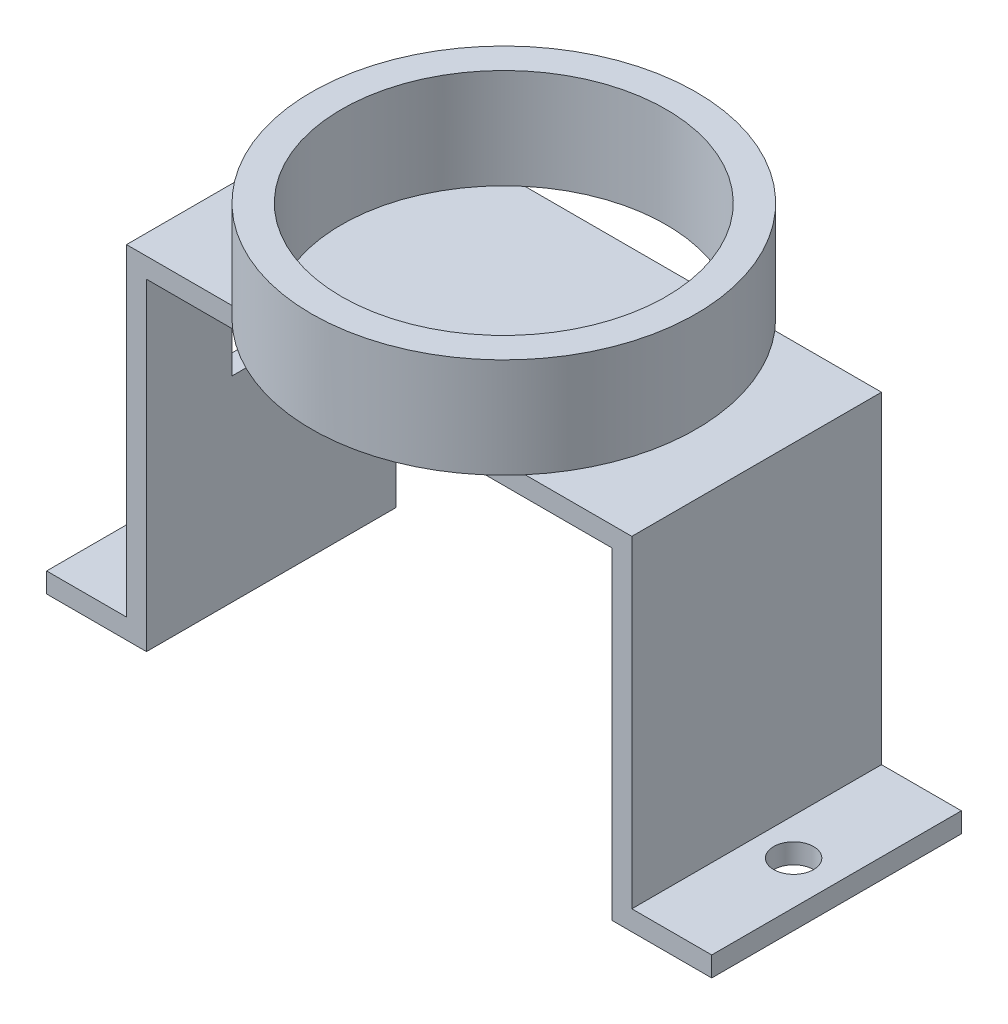
ISO-10303-21;
HEADER;
FILE_DESCRIPTION(('STEP AP214'),'2;1');
FILE_NAME('part.step','',(''),(''),'','','');
FILE_SCHEMA(('AUTOMOTIVE_DESIGN { 1 0 10303 214 1 1 1 1 }'));
ENDSEC;
DATA;
#1=APPLICATION_CONTEXT('core data for automotive mechanical design processes');
#2=APPLICATION_PROTOCOL_DEFINITION('international standard','automotive_design',2000,#1);
#3=PRODUCT_CONTEXT('',#1,'mechanical');
#4=PRODUCT('Part','Part','',(#3));
#5=PRODUCT_RELATED_PRODUCT_CATEGORY('part','',(#4));
#6=PRODUCT_DEFINITION_FORMATION('','',#4);
#7=PRODUCT_DEFINITION_CONTEXT('part definition',#1,'design');
#8=PRODUCT_DEFINITION('design','',#6,#7);
#9=PRODUCT_DEFINITION_SHAPE('','',#8);
#10=(LENGTH_UNIT() NAMED_UNIT(*) SI_UNIT(.MILLI.,.METRE.));
#11=(NAMED_UNIT(*) PLANE_ANGLE_UNIT() SI_UNIT($,.RADIAN.));
#12=(NAMED_UNIT(*) SI_UNIT($,.STERADIAN.) SOLID_ANGLE_UNIT());
#13=UNCERTAINTY_MEASURE_WITH_UNIT(LENGTH_MEASURE(1.E-05),#10,'distance_accuracy_value','');
#14=(GEOMETRIC_REPRESENTATION_CONTEXT(3) GLOBAL_UNCERTAINTY_ASSIGNED_CONTEXT((#13)) GLOBAL_UNIT_ASSIGNED_CONTEXT((#10,
#11,#12)) REPRESENTATION_CONTEXT('',''));
#15=CARTESIAN_POINT('',(0.,0.,0.));
#16=DIRECTION('',(0.,0.,1.));
#17=DIRECTION('',(1.,0.,0.));
#18=AXIS2_PLACEMENT_3D('',#15,#16,#17);
#19=CARTESIAN_POINT('',(0.,17.15,12.5));
#20=DIRECTION('',(0.,1.,0.));
#21=DIRECTION('',(0.,0.,1.));
#22=AXIS2_PLACEMENT_3D('',#19,#20,#21);
#23=PLANE('',#22);
#24=DIRECTION('',(1.,0.,0.));
#25=VECTOR('',#24,1.);
#26=CARTESIAN_POINT('',(0.,17.15,12.5));
#27=LINE('',#26,#25);
#28=CARTESIAN_POINT('',(6.4483600856761,17.15,12.5));
#29=VERTEX_POINT('',#28);
#30=CARTESIAN_POINT('',(16.8316399143243,17.15,12.5));
#31=VERTEX_POINT('',#30);
#32=EDGE_CURVE('E179',#29,#31,#27,.T.);
#33=ORIENTED_EDGE('',*,*,#32,.T.);
#34=CARTESIAN_POINT('',(11.6400000000002,17.15,6.25000000000026));
#35=DIRECTION('',(0.,1.,0.));
#36=DIRECTION('',(0.,0.,1.));
#37=AXIS2_PLACEMENT_3D('',#34,#35,#36);
#38=CIRCLE('',#37,8.125);
#39=CARTESIAN_POINT('',(16.8316399143237,17.15,0.));
#40=VERTEX_POINT('',#39);
#41=EDGE_CURVE('E218',#31,#40,#38,.T.);
#42=ORIENTED_EDGE('',*,*,#41,.T.);
#43=DIRECTION('',(1.,0.,0.));
#44=VECTOR('',#43,1.);
#45=CARTESIAN_POINT('',(0.,17.15,0.));
#46=LINE('',#45,#44);
#47=CARTESIAN_POINT('',(6.44836008567671,17.15,0.));
#48=VERTEX_POINT('',#47);
#49=EDGE_CURVE('E266',#48,#40,#46,.T.);
#50=ORIENTED_EDGE('',*,*,#49,.F.);
#51=EDGE_CURVE('E41',#48,#29,#38,.T.);
#52=ORIENTED_EDGE('',*,*,#51,.T.);
#53=EDGE_LOOP('',(#33,#42,#50,#52));
#54=FACE_BOUND('',#53,.T.);
#55=ADVANCED_FACE('F32',(#54),#23,.T.);
#56=CARTESIAN_POINT('',(11.6400000000002,17.15,6.25000000000026));
#57=DIRECTION('',(0.,1.,0.));
#58=DIRECTION('',(0.,0.,1.));
#59=AXIS2_PLACEMENT_3D('',#56,#57,#58);
#60=CIRCLE('',#59,9.625);
#61=CARTESIAN_POINT('',(18.9597079859791,17.15,12.5));
#62=VERTEX_POINT('',#61);
#63=CARTESIAN_POINT('',(18.9597079859787,17.15,0.));
#64=VERTEX_POINT('',#63);
#65=EDGE_CURVE('E43',#62,#64,#60,.T.);
#66=ORIENTED_EDGE('',*,*,#65,.F.);
#67=CARTESIAN_POINT('',(24.3,17.15,12.5));
#68=VERTEX_POINT('',#67);
#69=EDGE_CURVE('E180',#62,#68,#27,.T.);
#70=ORIENTED_EDGE('',*,*,#69,.T.);
#71=DIRECTION('',(0.,0.,-1.));
#72=VECTOR('',#71,1.);
#73=CARTESIAN_POINT('',(24.3,17.15,12.5));
#74=LINE('',#73,#72);
#75=CARTESIAN_POINT('',(24.3,17.15,0.));
#76=VERTEX_POINT('',#75);
#77=EDGE_CURVE('E236',#68,#76,#74,.T.);
#78=ORIENTED_EDGE('',*,*,#77,.T.);
#79=EDGE_CURVE('E195',#64,#76,#46,.T.);
#80=ORIENTED_EDGE('',*,*,#79,.F.);
#81=EDGE_LOOP('',(#66,#70,#78,#80));
#82=FACE_BOUND('',#81,.T.);
#83=ADVANCED_FACE('F192',(#82),#23,.T.);
#84=CARTESIAN_POINT('',(23.3,0.,12.5));
#85=DIRECTION('',(0.,1.,0.));
#86=DIRECTION('',(0.,0.,1.));
#87=AXIS2_PLACEMENT_3D('',#84,#85,#86);
#88=PLANE('',#87);
#89=CARTESIAN_POINT('',(26.15,0.,6.25));
#90=DIRECTION('',(0.,1.,0.));
#91=DIRECTION('',(-1.,0.,0.));
#92=AXIS2_PLACEMENT_3D('',#89,#90,#91);
#93=CIRCLE('',#92,1.00000000000007);
#94=CARTESIAN_POINT('',(25.1499999999999,0.,6.25));
#95=VERTEX_POINT('',#94);
#96=EDGE_CURVE('E405',#95,#95,#93,.T.);
#97=ORIENTED_EDGE('',*,*,#96,.T.);
#98=EDGE_LOOP('',(#97));
#99=FACE_BOUND('',#98,.T.);
#100=DIRECTION('',(1.,0.,0.));
#101=VECTOR('',#100,1.);
#102=CARTESIAN_POINT('',(23.3,0.,0.));
#103=LINE('',#102,#101);
#104=CARTESIAN_POINT('',(23.3,0.,0.));
#105=VERTEX_POINT('',#104);
#106=CARTESIAN_POINT('',(28.3,0.,0.));
#107=VERTEX_POINT('',#106);
#108=EDGE_CURVE('E366',#105,#107,#103,.T.);
#109=ORIENTED_EDGE('',*,*,#108,.T.);
#110=DIRECTION('',(0.,0.,-1.));
#111=VECTOR('',#110,1.);
#112=CARTESIAN_POINT('',(28.3,0.,12.5));
#113=LINE('',#112,#111);
#114=CARTESIAN_POINT('',(28.3,0.,12.5));
#115=VERTEX_POINT('',#114);
#116=EDGE_CURVE('E247',#115,#107,#113,.T.);
#117=ORIENTED_EDGE('',*,*,#116,.F.);
#118=DIRECTION('',(1.,0.,0.));
#119=VECTOR('',#118,1.);
#120=CARTESIAN_POINT('',(23.3,0.,12.5));
#121=LINE('',#120,#119);
#122=CARTESIAN_POINT('',(23.3,0.,12.5));
#123=VERTEX_POINT('',#122);
#124=EDGE_CURVE('E291',#123,#115,#121,.T.);
#125=ORIENTED_EDGE('',*,*,#124,.F.);
#126=DIRECTION('',(0.,0.,-1.));
#127=VECTOR('',#126,1.);
#128=CARTESIAN_POINT('',(23.3,0.,12.5));
#129=LINE('',#128,#127);
#130=EDGE_CURVE('E292',#123,#105,#129,.T.);
#131=ORIENTED_EDGE('',*,*,#130,.T.);
#132=EDGE_LOOP('',(#109,#117,#125,#131));
#133=FACE_BOUND('',#132,.T.);
#134=ADVANCED_FACE('F34',(#99,#133),#88,.F.);
#135=CARTESIAN_POINT('',(28.3,1.,12.5));
#136=DIRECTION('',(1.,0.,0.));
#137=DIRECTION('',(0.,0.,-1.));
#138=AXIS2_PLACEMENT_3D('',#135,#136,#137);
#139=PLANE('',#138);
#140=DIRECTION('',(0.,-1.,0.));
#141=VECTOR('',#140,1.);
#142=CARTESIAN_POINT('',(28.3,1.,0.));
#143=LINE('',#142,#141);
#144=CARTESIAN_POINT('',(28.3,1.,0.));
#145=VERTEX_POINT('',#144);
#146=EDGE_CURVE('E359',#145,#107,#143,.T.);
#147=ORIENTED_EDGE('',*,*,#146,.F.);
#148=DIRECTION('',(0.,0.,-1.));
#149=VECTOR('',#148,1.);
#150=CARTESIAN_POINT('',(28.3,1.,12.5));
#151=LINE('',#150,#149);
#152=CARTESIAN_POINT('',(28.3,1.,12.5));
#153=VERTEX_POINT('',#152);
#154=EDGE_CURVE('E245',#153,#145,#151,.T.);
#155=ORIENTED_EDGE('',*,*,#154,.F.);
#156=DIRECTION('',(0.,-1.,0.));
#157=VECTOR('',#156,1.);
#158=CARTESIAN_POINT('',(28.3,1.,12.5));
#159=LINE('',#158,#157);
#160=EDGE_CURVE('E396',#153,#115,#159,.T.);
#161=ORIENTED_EDGE('',*,*,#160,.T.);
#162=ORIENTED_EDGE('',*,*,#116,.T.);
#163=EDGE_LOOP('',(#147,#155,#161,#162));
#164=FACE_BOUND('',#163,.T.);
#165=ADVANCED_FACE('F347',(#164),#139,.T.);
#166=CARTESIAN_POINT('',(23.3,1.,12.5));
#167=DIRECTION('',(0.,1.,0.));
#168=DIRECTION('',(0.,0.,1.));
#169=AXIS2_PLACEMENT_3D('',#166,#167,#168);
#170=PLANE('',#169);
#171=CARTESIAN_POINT('',(26.15,1.,6.25));
#172=DIRECTION('',(0.,1.,0.));
#173=DIRECTION('',(-1.,0.,0.));
#174=AXIS2_PLACEMENT_3D('',#171,#172,#173);
#175=CIRCLE('',#174,1.00000000000007);
#176=CARTESIAN_POINT('',(25.1499999999999,1.,6.25));
#177=VERTEX_POINT('',#176);
#178=EDGE_CURVE('E400',#177,#177,#175,.T.);
#179=ORIENTED_EDGE('',*,*,#178,.F.);
#180=EDGE_LOOP('',(#179));
#181=FACE_BOUND('',#180,.T.);
#182=DIRECTION('',(1.,0.,0.));
#183=VECTOR('',#182,1.);
#184=CARTESIAN_POINT('',(23.3,1.,0.));
#185=LINE('',#184,#183);
#186=CARTESIAN_POINT('',(24.3,1.,0.));
#187=VERTEX_POINT('',#186);
#188=EDGE_CURVE('E365',#187,#145,#185,.T.);
#189=ORIENTED_EDGE('',*,*,#188,.F.);
#190=DIRECTION('',(0.,0.,-1.));
#191=VECTOR('',#190,1.);
#192=CARTESIAN_POINT('',(24.3,1.,12.5));
#193=LINE('',#192,#191);
#194=CARTESIAN_POINT('',(24.3,1.,12.5));
#195=VERTEX_POINT('',#194);
#196=EDGE_CURVE('E243',#195,#187,#193,.T.);
#197=ORIENTED_EDGE('',*,*,#196,.F.);
#198=DIRECTION('',(1.,0.,0.));
#199=VECTOR('',#198,1.);
#200=CARTESIAN_POINT('',(23.3,1.,12.5));
#201=LINE('',#200,#199);
#202=EDGE_CURVE('E204',#195,#153,#201,.T.);
#203=ORIENTED_EDGE('',*,*,#202,.T.);
#204=ORIENTED_EDGE('',*,*,#154,.T.);
#205=EDGE_LOOP('',(#189,#197,#203,#204));
#206=FACE_BOUND('',#205,.T.);
#207=ADVANCED_FACE('F342',(#181,#206),#170,.T.);
#208=CARTESIAN_POINT('',(24.3,0.,12.5));
#209=DIRECTION('',(1.,0.,0.));
#210=DIRECTION('',(0.,0.,-1.));
#211=AXIS2_PLACEMENT_3D('',#208,#209,#210);
#212=PLANE('',#211);
#213=DIRECTION('',(0.,1.,0.));
#214=VECTOR('',#213,1.);
#215=CARTESIAN_POINT('',(24.3,0.,0.));
#216=LINE('',#215,#214);
#217=EDGE_CURVE('E275',#76,#187,#216,.F.);
#218=ORIENTED_EDGE('',*,*,#217,.F.);
#219=ORIENTED_EDGE('',*,*,#77,.F.);
#220=DIRECTION('',(0.,1.,0.));
#221=VECTOR('',#220,1.);
#222=CARTESIAN_POINT('',(24.3,0.,12.5));
#223=LINE('',#222,#221);
#224=EDGE_CURVE('E202',#68,#195,#223,.F.);
#225=ORIENTED_EDGE('',*,*,#224,.T.);
#226=ORIENTED_EDGE('',*,*,#196,.T.);
#227=EDGE_LOOP('',(#218,#219,#225,#226));
#228=FACE_BOUND('',#227,.T.);
#229=ADVANCED_FACE('F338',(#228),#212,.T.);
#230=CARTESIAN_POINT('',(4.32029201402175,17.15,0.));
#231=VERTEX_POINT('',#230);
#232=CARTESIAN_POINT('',(4.32029201402131,17.15,12.5));
#233=VERTEX_POINT('',#232);
#234=EDGE_CURVE('E11',#231,#233,#60,.T.);
#235=ORIENTED_EDGE('',*,*,#234,.F.);
#236=CARTESIAN_POINT('',(-1.,17.15,0.));
#237=VERTEX_POINT('',#236);
#238=EDGE_CURVE('E272',#237,#231,#46,.T.);
#239=ORIENTED_EDGE('',*,*,#238,.F.);
#240=DIRECTION('',(0.,0.,-1.));
#241=VECTOR('',#240,1.);
#242=CARTESIAN_POINT('',(-1.,17.15,12.5));
#243=LINE('',#242,#241);
#244=CARTESIAN_POINT('',(-1.,17.15,12.5));
#245=VERTEX_POINT('',#244);
#246=EDGE_CURVE('E226',#245,#237,#243,.T.);
#247=ORIENTED_EDGE('',*,*,#246,.F.);
#248=EDGE_CURVE('E203',#245,#233,#27,.T.);
#249=ORIENTED_EDGE('',*,*,#248,.T.);
#250=EDGE_LOOP('',(#235,#239,#247,#249));
#251=FACE_BOUND('',#250,.T.);
#252=ADVANCED_FACE('F327',(#251),#23,.T.);
#253=CARTESIAN_POINT('',(-1.,0.,12.5));
#254=DIRECTION('',(-1.,0.,0.));
#255=DIRECTION('',(0.,0.,1.));
#256=AXIS2_PLACEMENT_3D('',#253,#254,#255);
#257=PLANE('',#256);
#258=DIRECTION('',(0.,-1.,0.));
#259=VECTOR('',#258,1.);
#260=CARTESIAN_POINT('',(-1.,9.81358298331912,4.25580279308205));
#261=LINE('',#260,#259);
#262=CARTESIAN_POINT('',(-1.,11.8367631685415,4.25580279308205));
#263=VERTEX_POINT('',#262);
#264=CARTESIAN_POINT('',(-1.,9.81358298331912,4.25580279308205));
#265=VERTEX_POINT('',#264);
#266=EDGE_CURVE('E431',#263,#265,#261,.T.);
#267=ORIENTED_EDGE('',*,*,#266,.F.);
#268=DIRECTION('',(0.,0.,-1.));
#269=VECTOR('',#268,1.);
#270=CARTESIAN_POINT('',(-1.,11.8367631685415,4.25580279308205));
#271=LINE('',#270,#269);
#272=CARTESIAN_POINT('',(-1.,11.8367631685415,8.22521721057937));
#273=VERTEX_POINT('',#272);
#274=EDGE_CURVE('E418',#273,#263,#271,.T.);
#275=ORIENTED_EDGE('',*,*,#274,.F.);
#276=DIRECTION('',(0.,1.,0.));
#277=VECTOR('',#276,1.);
#278=CARTESIAN_POINT('',(-1.,9.81358298331912,8.22521721057937));
#279=LINE('',#278,#277);
#280=CARTESIAN_POINT('',(-1.,9.81358298331912,8.22521721057937));
#281=VERTEX_POINT('',#280);
#282=EDGE_CURVE('E425',#281,#273,#279,.T.);
#283=ORIENTED_EDGE('',*,*,#282,.F.);
#284=DIRECTION('',(0.,0.,1.));
#285=VECTOR('',#284,1.);
#286=CARTESIAN_POINT('',(-1.,9.81358298331912,4.25580279308205));
#287=LINE('',#286,#285);
#288=EDGE_CURVE('E428',#265,#281,#287,.T.);
#289=ORIENTED_EDGE('',*,*,#288,.F.);
#290=EDGE_LOOP('',(#267,#275,#283,#289));
#291=FACE_BOUND('',#290,.T.);
#292=DIRECTION('',(0.,1.,0.));
#293=VECTOR('',#292,1.);
#294=CARTESIAN_POINT('',(-1.,0.,0.));
#295=LINE('',#294,#293);
#296=CARTESIAN_POINT('',(-1.,1.,0.));
#297=VERTEX_POINT('',#296);
#298=EDGE_CURVE('E230',#297,#237,#295,.T.);
#299=ORIENTED_EDGE('',*,*,#298,.F.);
#300=DIRECTION('',(0.,0.,-1.));
#301=VECTOR('',#300,1.);
#302=CARTESIAN_POINT('',(-1.,1.,12.5));
#303=LINE('',#302,#301);
#304=CARTESIAN_POINT('',(-1.,1.,12.5));
#305=VERTEX_POINT('',#304);
#306=EDGE_CURVE('E228',#305,#297,#303,.T.);
#307=ORIENTED_EDGE('',*,*,#306,.F.);
#308=DIRECTION('',(0.,1.,0.));
#309=VECTOR('',#308,1.);
#310=CARTESIAN_POINT('',(-1.,0.,12.5));
#311=LINE('',#310,#309);
#312=EDGE_CURVE('E208',#305,#245,#311,.T.);
#313=ORIENTED_EDGE('',*,*,#312,.T.);
#314=ORIENTED_EDGE('',*,*,#246,.T.);
#315=EDGE_LOOP('',(#299,#307,#313,#314));
#316=FACE_BOUND('',#315,.T.);
#317=ADVANCED_FACE('F225',(#291,#316),#257,.T.);
#318=CARTESIAN_POINT('',(0.,1.,12.5));
#319=DIRECTION('',(0.,1.,0.));
#320=DIRECTION('',(-1.,0.,0.));
#321=AXIS2_PLACEMENT_3D('',#318,#319,#320);
#322=PLANE('',#321);
#323=CARTESIAN_POINT('',(-2.85000000000001,1.,6.25000000000001));
#324=DIRECTION('',(0.,1.,0.));
#325=DIRECTION('',(-1.,0.,0.));
#326=AXIS2_PLACEMENT_3D('',#323,#324,#325);
#327=CIRCLE('',#326,1.00000000000006);
#328=CARTESIAN_POINT('',(-3.85000000000006,0.999999999999999,6.25000000000001));
#329=VERTEX_POINT('',#328);
#330=EDGE_CURVE('E409',#329,#329,#327,.T.);
#331=ORIENTED_EDGE('',*,*,#330,.F.);
#332=EDGE_LOOP('',(#331));
#333=FACE_BOUND('',#332,.T.);
#334=DIRECTION('',(1.,0.,0.));
#335=VECTOR('',#334,1.);
#336=CARTESIAN_POINT('',(0.,1.,0.));
#337=LINE('',#336,#335);
#338=CARTESIAN_POINT('',(-5.,0.999999999999999,0.));
#339=VERTEX_POINT('',#338);
#340=EDGE_CURVE('E278',#339,#297,#337,.T.);
#341=ORIENTED_EDGE('',*,*,#340,.F.);
#342=DIRECTION('',(0.,0.,-1.));
#343=VECTOR('',#342,1.);
#344=CARTESIAN_POINT('',(-5.,0.999999999999999,12.5));
#345=LINE('',#344,#343);
#346=CARTESIAN_POINT('',(-5.,0.999999999999999,12.5));
#347=VERTEX_POINT('',#346);
#348=EDGE_CURVE('E234',#347,#339,#345,.T.);
#349=ORIENTED_EDGE('',*,*,#348,.F.);
#350=DIRECTION('',(1.,0.,0.));
#351=VECTOR('',#350,1.);
#352=CARTESIAN_POINT('',(0.,1.,12.5));
#353=LINE('',#352,#351);
#354=EDGE_CURVE('E213',#347,#305,#353,.T.);
#355=ORIENTED_EDGE('',*,*,#354,.T.);
#356=ORIENTED_EDGE('',*,*,#306,.T.);
#357=EDGE_LOOP('',(#341,#349,#355,#356));
#358=FACE_BOUND('',#357,.T.);
#359=ADVANCED_FACE('F318',(#333,#358),#322,.T.);
#360=CARTESIAN_POINT('',(-5.,0.,12.5));
#361=DIRECTION('',(-1.,0.,0.));
#362=DIRECTION('',(0.,0.,1.));
#363=AXIS2_PLACEMENT_3D('',#360,#361,#362);
#364=PLANE('',#363);
#365=DIRECTION('',(0.,1.,0.));
#366=VECTOR('',#365,1.);
#367=CARTESIAN_POINT('',(-5.,0.,0.));
#368=LINE('',#367,#366);
#369=CARTESIAN_POINT('',(-5.,0.,0.));
#370=VERTEX_POINT('',#369);
#371=EDGE_CURVE('E280',#370,#339,#368,.T.);
#372=ORIENTED_EDGE('',*,*,#371,.F.);
#373=DIRECTION('',(0.,0.,-1.));
#374=VECTOR('',#373,1.);
#375=CARTESIAN_POINT('',(-5.,0.,12.5));
#376=LINE('',#375,#374);
#377=CARTESIAN_POINT('',(-5.,0.,12.5));
#378=VERTEX_POINT('',#377);
#379=EDGE_CURVE('E238',#378,#370,#376,.T.);
#380=ORIENTED_EDGE('',*,*,#379,.F.);
#381=DIRECTION('',(0.,1.,0.));
#382=VECTOR('',#381,1.);
#383=CARTESIAN_POINT('',(-5.,0.,12.5));
#384=LINE('',#383,#382);
#385=EDGE_CURVE('E317',#378,#347,#384,.T.);
#386=ORIENTED_EDGE('',*,*,#385,.T.);
#387=ORIENTED_EDGE('',*,*,#348,.T.);
#388=EDGE_LOOP('',(#372,#380,#386,#387));
#389=FACE_BOUND('',#388,.T.);
#390=ADVANCED_FACE('F316',(#389),#364,.T.);
#391=CARTESIAN_POINT('',(0.,0.,12.5));
#392=DIRECTION('',(0.,1.,0.));
#393=DIRECTION('',(-1.,0.,0.));
#394=AXIS2_PLACEMENT_3D('',#391,#392,#393);
#395=PLANE('',#394);
#396=CARTESIAN_POINT('',(-2.85000000000001,0.,6.25000000000001));
#397=DIRECTION('',(0.,1.,0.));
#398=DIRECTION('',(-1.,0.,0.));
#399=AXIS2_PLACEMENT_3D('',#396,#397,#398);
#400=CIRCLE('',#399,1.00000000000006);
#401=CARTESIAN_POINT('',(-3.85000000000006,0.,6.25000000000001));
#402=VERTEX_POINT('',#401);
#403=EDGE_CURVE('E373',#402,#402,#400,.T.);
#404=ORIENTED_EDGE('',*,*,#403,.T.);
#405=EDGE_LOOP('',(#404));
#406=FACE_BOUND('',#405,.T.);
#407=DIRECTION('',(1.,0.,0.));
#408=VECTOR('',#407,1.);
#409=CARTESIAN_POINT('',(0.,0.,0.));
#410=LINE('',#409,#408);
#411=CARTESIAN_POINT('',(0.,0.,0.));
#412=VERTEX_POINT('',#411);
#413=EDGE_CURVE('E283',#370,#412,#410,.T.);
#414=ORIENTED_EDGE('',*,*,#413,.T.);
#415=DIRECTION('',(0.,0.,-1.));
#416=VECTOR('',#415,1.);
#417=CARTESIAN_POINT('',(0.,0.,12.5));
#418=LINE('',#417,#416);
#419=CARTESIAN_POINT('',(0.,0.,12.5));
#420=VERTEX_POINT('',#419);
#421=EDGE_CURVE('E302',#420,#412,#418,.T.);
#422=ORIENTED_EDGE('',*,*,#421,.F.);
#423=DIRECTION('',(1.,0.,0.));
#424=VECTOR('',#423,1.);
#425=CARTESIAN_POINT('',(0.,0.,12.5));
#426=LINE('',#425,#424);
#427=EDGE_CURVE('E309',#378,#420,#426,.T.);
#428=ORIENTED_EDGE('',*,*,#427,.F.);
#429=ORIENTED_EDGE('',*,*,#379,.T.);
#430=EDGE_LOOP('',(#414,#422,#428,#429));
#431=FACE_BOUND('',#430,.T.);
#432=ADVANCED_FACE('F307',(#406,#431),#395,.F.);
#433=CARTESIAN_POINT('',(0.,0.,12.5));
#434=DIRECTION('',(-1.,0.,0.));
#435=DIRECTION('',(0.,0.,1.));
#436=AXIS2_PLACEMENT_3D('',#433,#434,#435);
#437=PLANE('',#436);
#438=DIRECTION('',(0.,0.,-1.));
#439=VECTOR('',#438,1.);
#440=CARTESIAN_POINT('',(0.,11.8367631685415,12.5));
#441=LINE('',#440,#439);
#442=CARTESIAN_POINT('',(0.,11.8367631685415,8.22521721057937));
#443=VERTEX_POINT('',#442);
#444=CARTESIAN_POINT('',(0.,11.8367631685415,4.25580279308205));
#445=VERTEX_POINT('',#444);
#446=EDGE_CURVE('E254',#443,#445,#441,.T.);
#447=ORIENTED_EDGE('',*,*,#446,.T.);
#448=DIRECTION('',(0.,-1.,0.));
#449=VECTOR('',#448,1.);
#450=CARTESIAN_POINT('',(0.,0.,4.25580279308205));
#451=LINE('',#450,#449);
#452=CARTESIAN_POINT('',(0.,9.81358298331912,4.25580279308205));
#453=VERTEX_POINT('',#452);
#454=EDGE_CURVE('E36',#445,#453,#451,.T.);
#455=ORIENTED_EDGE('',*,*,#454,.T.);
#456=DIRECTION('',(0.,0.,1.));
#457=VECTOR('',#456,1.);
#458=CARTESIAN_POINT('',(0.,9.81358298331912,12.5));
#459=LINE('',#458,#457);
#460=CARTESIAN_POINT('',(0.,9.81358298331912,8.22521721057937));
#461=VERTEX_POINT('',#460);
#462=EDGE_CURVE('E249',#453,#461,#459,.T.);
#463=ORIENTED_EDGE('',*,*,#462,.T.);
#464=DIRECTION('',(0.,1.,0.));
#465=VECTOR('',#464,1.);
#466=CARTESIAN_POINT('',(0.,0.,8.22521721057937));
#467=LINE('',#466,#465);
#468=EDGE_CURVE('E252',#461,#443,#467,.T.);
#469=ORIENTED_EDGE('',*,*,#468,.T.);
#470=EDGE_LOOP('',(#447,#455,#463,#469));
#471=FACE_BOUND('',#470,.T.);
#472=DIRECTION('',(0.,1.,0.));
#473=VECTOR('',#472,1.);
#474=CARTESIAN_POINT('',(0.,0.,0.));
#475=LINE('',#474,#473);
#476=CARTESIAN_POINT('',(0.,16.15,0.));
#477=VERTEX_POINT('',#476);
#478=EDGE_CURVE('E285',#412,#477,#475,.T.);
#479=ORIENTED_EDGE('',*,*,#478,.T.);
#480=DIRECTION('',(0.,0.,-1.));
#481=VECTOR('',#480,1.);
#482=CARTESIAN_POINT('',(0.,16.15,12.5));
#483=LINE('',#482,#481);
#484=CARTESIAN_POINT('',(0.,16.15,12.5));
#485=VERTEX_POINT('',#484);
#486=EDGE_CURVE('E299',#485,#477,#483,.T.);
#487=ORIENTED_EDGE('',*,*,#486,.F.);
#488=DIRECTION('',(0.,1.,0.));
#489=VECTOR('',#488,1.);
#490=CARTESIAN_POINT('',(0.,0.,12.5));
#491=LINE('',#490,#489);
#492=EDGE_CURVE('E377',#420,#485,#491,.T.);
#493=ORIENTED_EDGE('',*,*,#492,.F.);
#494=ORIENTED_EDGE('',*,*,#421,.T.);
#495=EDGE_LOOP('',(#479,#487,#493,#494));
#496=FACE_BOUND('',#495,.T.);
#497=ADVANCED_FACE('F384',(#471,#496),#437,.F.);
#498=CARTESIAN_POINT('',(0.,16.15,12.5));
#499=DIRECTION('',(0.,1.,0.));
#500=DIRECTION('',(0.,0.,1.));
#501=AXIS2_PLACEMENT_3D('',#498,#499,#500);
#502=PLANE('',#501);
#503=DIRECTION('',(1.,0.,0.));
#504=VECTOR('',#503,1.);
#505=CARTESIAN_POINT('',(0.,16.15,0.));
#506=LINE('',#505,#504);
#507=CARTESIAN_POINT('',(23.3,16.15,0.));
#508=VERTEX_POINT('',#507);
#509=EDGE_CURVE('E287',#477,#508,#506,.T.);
#510=ORIENTED_EDGE('',*,*,#509,.T.);
#511=DIRECTION('',(0.,0.,-1.));
#512=VECTOR('',#511,1.);
#513=CARTESIAN_POINT('',(23.3,16.15,12.5));
#514=LINE('',#513,#512);
#515=CARTESIAN_POINT('',(23.3,16.15,12.5));
#516=VERTEX_POINT('',#515);
#517=EDGE_CURVE('E295',#516,#508,#514,.T.);
#518=ORIENTED_EDGE('',*,*,#517,.F.);
#519=DIRECTION('',(1.,0.,0.));
#520=VECTOR('',#519,1.);
#521=CARTESIAN_POINT('',(0.,16.15,12.5));
#522=LINE('',#521,#520);
#523=EDGE_CURVE('E375',#485,#516,#522,.T.);
#524=ORIENTED_EDGE('',*,*,#523,.F.);
#525=ORIENTED_EDGE('',*,*,#486,.T.);
#526=EDGE_LOOP('',(#510,#518,#524,#525));
#527=FACE_BOUND('',#526,.T.);
#528=ADVANCED_FACE('F388',(#527),#502,.F.);
#529=CARTESIAN_POINT('',(23.3,0.,12.5));
#530=DIRECTION('',(1.,0.,0.));
#531=DIRECTION('',(0.,0.,-1.));
#532=AXIS2_PLACEMENT_3D('',#529,#530,#531);
#533=PLANE('',#532);
#534=DIRECTION('',(0.,-1.,0.));
#535=VECTOR('',#534,1.);
#536=CARTESIAN_POINT('',(23.3,0.,0.));
#537=LINE('',#536,#535);
#538=EDGE_CURVE('E289',#508,#105,#537,.T.);
#539=ORIENTED_EDGE('',*,*,#538,.T.);
#540=ORIENTED_EDGE('',*,*,#130,.F.);
#541=DIRECTION('',(0.,-1.,0.));
#542=VECTOR('',#541,1.);
#543=CARTESIAN_POINT('',(23.3,0.,12.5));
#544=LINE('',#543,#542);
#545=EDGE_CURVE('E296',#516,#123,#544,.T.);
#546=ORIENTED_EDGE('',*,*,#545,.F.);
#547=ORIENTED_EDGE('',*,*,#517,.T.);
#548=EDGE_LOOP('',(#539,#540,#546,#547));
#549=FACE_BOUND('',#548,.T.);
#550=ADVANCED_FACE('F393',(#549),#533,.F.);
#551=CARTESIAN_POINT('',(0.,0.,12.5));
#552=DIRECTION('',(0.,0.,-1.));
#553=DIRECTION('',(-1.,0.,0.));
#554=AXIS2_PLACEMENT_3D('',#551,#552,#553);
#555=PLANE('',#554);
#556=ORIENTED_EDGE('',*,*,#124,.T.);
#557=ORIENTED_EDGE('',*,*,#160,.F.);
#558=ORIENTED_EDGE('',*,*,#202,.F.);
#559=ORIENTED_EDGE('',*,*,#224,.F.);
#560=ORIENTED_EDGE('',*,*,#69,.F.);
#561=EDGE_CURVE('E171',#31,#62,#27,.T.);
#562=ORIENTED_EDGE('',*,*,#561,.F.);
#563=ORIENTED_EDGE('',*,*,#32,.F.);
#564=EDGE_CURVE('E209',#233,#29,#27,.T.);
#565=ORIENTED_EDGE('',*,*,#564,.F.);
#566=ORIENTED_EDGE('',*,*,#248,.F.);
#567=ORIENTED_EDGE('',*,*,#312,.F.);
#568=ORIENTED_EDGE('',*,*,#354,.F.);
#569=ORIENTED_EDGE('',*,*,#385,.F.);
#570=ORIENTED_EDGE('',*,*,#427,.T.);
#571=ORIENTED_EDGE('',*,*,#492,.T.);
#572=ORIENTED_EDGE('',*,*,#523,.T.);
#573=ORIENTED_EDGE('',*,*,#545,.T.);
#574=EDGE_LOOP('',(#556,#557,#558,#559,#560,#562,#563,#565,#566,#567,#568,#569,#570,#571,#572,#573));
#575=FACE_BOUND('',#574,.T.);
#576=ADVANCED_FACE('F199',(#575),#555,.F.);
#577=CARTESIAN_POINT('',(0.,0.,0.));
#578=DIRECTION('',(0.,0.,-1.));
#579=DIRECTION('',(-1.,0.,0.));
#580=AXIS2_PLACEMENT_3D('',#577,#578,#579);
#581=PLANE('',#580);
#582=ORIENTED_EDGE('',*,*,#108,.F.);
#583=ORIENTED_EDGE('',*,*,#538,.F.);
#584=ORIENTED_EDGE('',*,*,#509,.F.);
#585=ORIENTED_EDGE('',*,*,#478,.F.);
#586=ORIENTED_EDGE('',*,*,#413,.F.);
#587=ORIENTED_EDGE('',*,*,#371,.T.);
#588=ORIENTED_EDGE('',*,*,#340,.T.);
#589=ORIENTED_EDGE('',*,*,#298,.T.);
#590=ORIENTED_EDGE('',*,*,#238,.T.);
#591=EDGE_CURVE('E264',#231,#48,#46,.T.);
#592=ORIENTED_EDGE('',*,*,#591,.T.);
#593=ORIENTED_EDGE('',*,*,#49,.T.);
#594=EDGE_CURVE('E265',#40,#64,#46,.T.);
#595=ORIENTED_EDGE('',*,*,#594,.T.);
#596=ORIENTED_EDGE('',*,*,#79,.T.);
#597=ORIENTED_EDGE('',*,*,#217,.T.);
#598=ORIENTED_EDGE('',*,*,#188,.T.);
#599=ORIENTED_EDGE('',*,*,#146,.T.);
#600=EDGE_LOOP('',(#582,#583,#584,#585,#586,#587,#588,#589,#590,#592,#593,#595,#596,#597,#598,#599));
#601=FACE_BOUND('',#600,.T.);
#602=ADVANCED_FACE('F271',(#601),#581,.T.);
#603=CARTESIAN_POINT('',(-2.85000000000001,0.,6.25000000000001));
#604=DIRECTION('',(0.,1.,0.));
#605=DIRECTION('',(-1.,0.,0.));
#606=AXIS2_PLACEMENT_3D('',#603,#604,#605);
#607=CYLINDRICAL_SURFACE('',#606,1.00000000000006);
#608=ORIENTED_EDGE('',*,*,#403,.F.);
#609=EDGE_LOOP('',(#608));
#610=FACE_BOUND('',#609,.T.);
#611=ORIENTED_EDGE('',*,*,#330,.T.);
#612=EDGE_LOOP('',(#611));
#613=FACE_BOUND('',#612,.T.);
#614=ADVANCED_FACE('F467',(#610,#613),#607,.F.);
#615=CARTESIAN_POINT('',(26.15,0.,6.25));
#616=DIRECTION('',(0.,1.,0.));
#617=DIRECTION('',(-1.,0.,0.));
#618=AXIS2_PLACEMENT_3D('',#615,#616,#617);
#619=CYLINDRICAL_SURFACE('',#618,1.00000000000007);
#620=ORIENTED_EDGE('',*,*,#96,.F.);
#621=EDGE_LOOP('',(#620));
#622=FACE_BOUND('',#621,.T.);
#623=ORIENTED_EDGE('',*,*,#178,.T.);
#624=EDGE_LOOP('',(#623));
#625=FACE_BOUND('',#624,.T.);
#626=ADVANCED_FACE('F465',(#622,#625),#619,.F.);
#627=CARTESIAN_POINT('',(2.,9.81358298331912,4.25580279308205));
#628=DIRECTION('',(0.,0.,-1.));
#629=DIRECTION('',(-1.,0.,0.));
#630=AXIS2_PLACEMENT_3D('',#627,#628,#629);
#631=PLANE('',#630);
#632=DIRECTION('',(-1.,0.,0.));
#633=VECTOR('',#632,1.);
#634=CARTESIAN_POINT('',(2.,11.8367631685415,4.25580279308205));
#635=LINE('',#634,#633);
#636=EDGE_CURVE('E406',#445,#263,#635,.T.);
#637=ORIENTED_EDGE('',*,*,#636,.T.);
#638=ORIENTED_EDGE('',*,*,#266,.T.);
#639=DIRECTION('',(-1.,0.,0.));
#640=VECTOR('',#639,1.);
#641=CARTESIAN_POINT('',(2.,9.81358298331912,4.25580279308205));
#642=LINE('',#641,#640);
#643=EDGE_CURVE('E414',#453,#265,#642,.T.);
#644=ORIENTED_EDGE('',*,*,#643,.F.);
#645=ORIENTED_EDGE('',*,*,#454,.F.);
#646=EDGE_LOOP('',(#637,#638,#644,#645));
#647=FACE_BOUND('',#646,.T.);
#648=ADVANCED_FACE('F454',(#647),#631,.F.);
#649=CARTESIAN_POINT('',(2.,11.8367631685415,4.25580279308205));
#650=DIRECTION('',(0.,1.,0.));
#651=DIRECTION('',(0.,0.,1.));
#652=AXIS2_PLACEMENT_3D('',#649,#650,#651);
#653=PLANE('',#652);
#654=DIRECTION('',(-1.,0.,0.));
#655=VECTOR('',#654,1.);
#656=CARTESIAN_POINT('',(2.,11.8367631685415,8.22521721057937));
#657=LINE('',#656,#655);
#658=EDGE_CURVE('E420',#443,#273,#657,.T.);
#659=ORIENTED_EDGE('',*,*,#658,.T.);
#660=ORIENTED_EDGE('',*,*,#274,.T.);
#661=ORIENTED_EDGE('',*,*,#636,.F.);
#662=ORIENTED_EDGE('',*,*,#446,.F.);
#663=EDGE_LOOP('',(#659,#660,#661,#662));
#664=FACE_BOUND('',#663,.T.);
#665=ADVANCED_FACE('F450',(#664),#653,.F.);
#666=CARTESIAN_POINT('',(2.,9.81358298331912,8.22521721057937));
#667=DIRECTION('',(0.,0.,1.));
#668=DIRECTION('',(1.,0.,0.));
#669=AXIS2_PLACEMENT_3D('',#666,#667,#668);
#670=PLANE('',#669);
#671=DIRECTION('',(-1.,0.,0.));
#672=VECTOR('',#671,1.);
#673=CARTESIAN_POINT('',(2.,9.81358298331912,8.22521721057937));
#674=LINE('',#673,#672);
#675=EDGE_CURVE('E417',#461,#281,#674,.T.);
#676=ORIENTED_EDGE('',*,*,#675,.T.);
#677=ORIENTED_EDGE('',*,*,#282,.T.);
#678=ORIENTED_EDGE('',*,*,#658,.F.);
#679=ORIENTED_EDGE('',*,*,#468,.F.);
#680=EDGE_LOOP('',(#676,#677,#678,#679));
#681=FACE_BOUND('',#680,.T.);
#682=ADVANCED_FACE('F453',(#681),#670,.F.);
#683=CARTESIAN_POINT('',(2.,9.81358298331912,4.25580279308205));
#684=DIRECTION('',(0.,-1.,0.));
#685=DIRECTION('',(0.,0.,-1.));
#686=AXIS2_PLACEMENT_3D('',#683,#684,#685);
#687=PLANE('',#686);
#688=ORIENTED_EDGE('',*,*,#643,.T.);
#689=ORIENTED_EDGE('',*,*,#288,.T.);
#690=ORIENTED_EDGE('',*,*,#675,.F.);
#691=ORIENTED_EDGE('',*,*,#462,.F.);
#692=EDGE_LOOP('',(#688,#689,#690,#691));
#693=FACE_BOUND('',#692,.T.);
#694=ADVANCED_FACE('F458',(#693),#687,.F.);
#695=CARTESIAN_POINT('',(11.6400000000002,17.15,6.25000000000026));
#696=DIRECTION('',(0.,1.,0.));
#697=DIRECTION('',(0.,0.,1.));
#698=AXIS2_PLACEMENT_3D('',#695,#696,#697);
#699=PLANE('',#698);
#700=EDGE_CURVE('E174',#233,#62,#60,.T.);
#701=ORIENTED_EDGE('',*,*,#700,.F.);
#702=ORIENTED_EDGE('',*,*,#564,.T.);
#703=EDGE_CURVE('E51',#29,#31,#38,.T.);
#704=ORIENTED_EDGE('',*,*,#703,.T.);
#705=ORIENTED_EDGE('',*,*,#561,.T.);
#706=EDGE_LOOP('',(#701,#702,#704,#705));
#707=FACE_BOUND('',#706,.T.);
#708=ADVANCED_FACE('F173',(#707),#699,.F.);
#709=CARTESIAN_POINT('',(11.6400000000002,22.15,6.25000000000026));
#710=DIRECTION('',(0.,1.,0.));
#711=DIRECTION('',(0.,0.,1.));
#712=AXIS2_PLACEMENT_3D('',#709,#710,#711);
#713=PLANE('',#712);
#714=CARTESIAN_POINT('',(11.6400000000002,22.15,6.25000000000026));
#715=DIRECTION('',(0.,1.,0.));
#716=DIRECTION('',(0.,0.,1.));
#717=AXIS2_PLACEMENT_3D('',#714,#715,#716);
#718=CIRCLE('',#717,9.625);
#719=CARTESIAN_POINT('',(11.6400000000002,22.15,15.8750000000003));
#720=VERTEX_POINT('',#719);
#721=EDGE_CURVE('E197',#720,#720,#718,.T.);
#722=ORIENTED_EDGE('',*,*,#721,.T.);
#723=EDGE_LOOP('',(#722));
#724=FACE_BOUND('',#723,.T.);
#725=CARTESIAN_POINT('',(11.6400000000002,22.15,6.25000000000026));
#726=DIRECTION('',(0.,1.,0.));
#727=DIRECTION('',(0.,0.,1.));
#728=AXIS2_PLACEMENT_3D('',#725,#726,#727);
#729=CIRCLE('',#728,8.125);
#730=CARTESIAN_POINT('',(11.6400000000002,22.15,14.3750000000003));
#731=VERTEX_POINT('',#730);
#732=EDGE_CURVE('E190',#731,#731,#729,.T.);
#733=ORIENTED_EDGE('',*,*,#732,.F.);
#734=EDGE_LOOP('',(#733));
#735=FACE_BOUND('',#734,.T.);
#736=ADVANCED_FACE('F435',(#724,#735),#713,.T.);
#737=ORIENTED_EDGE('',*,*,#591,.F.);
#738=EDGE_CURVE('E44',#64,#231,#60,.T.);
#739=ORIENTED_EDGE('',*,*,#738,.F.);
#740=ORIENTED_EDGE('',*,*,#594,.F.);
#741=EDGE_CURVE('E56',#40,#48,#38,.T.);
#742=ORIENTED_EDGE('',*,*,#741,.T.);
#743=EDGE_LOOP('',(#737,#739,#740,#742));
#744=FACE_BOUND('',#743,.T.);
#745=ADVANCED_FACE('F262',(#744),#699,.F.);
#746=CARTESIAN_POINT('',(11.6400000000002,22.15,6.25000000000026));
#747=DIRECTION('',(0.,-1.,0.));
#748=DIRECTION('',(0.,0.,-1.));
#749=AXIS2_PLACEMENT_3D('',#746,#747,#748);
#750=CYLINDRICAL_SURFACE('',#749,9.625);
#751=ORIENTED_EDGE('',*,*,#721,.F.);
#752=EDGE_LOOP('',(#751));
#753=FACE_BOUND('',#752,.T.);
#754=ORIENTED_EDGE('',*,*,#65,.T.);
#755=ORIENTED_EDGE('',*,*,#738,.T.);
#756=ORIENTED_EDGE('',*,*,#234,.T.);
#757=ORIENTED_EDGE('',*,*,#700,.T.);
#758=EDGE_LOOP('',(#754,#755,#756,#757));
#759=FACE_BOUND('',#758,.T.);
#760=ADVANCED_FACE('F185',(#753,#759),#750,.T.);
#761=CARTESIAN_POINT('',(11.6400000000002,22.15,6.25000000000026));
#762=DIRECTION('',(0.,-1.,0.));
#763=DIRECTION('',(0.,0.,-1.));
#764=AXIS2_PLACEMENT_3D('',#761,#762,#763);
#765=CYLINDRICAL_SURFACE('',#764,8.125);
#766=ORIENTED_EDGE('',*,*,#732,.T.);
#767=EDGE_LOOP('',(#766));
#768=FACE_BOUND('',#767,.T.);
#769=ORIENTED_EDGE('',*,*,#41,.F.);
#770=ORIENTED_EDGE('',*,*,#703,.F.);
#771=ORIENTED_EDGE('',*,*,#51,.F.);
#772=ORIENTED_EDGE('',*,*,#741,.F.);
#773=EDGE_LOOP('',(#769,#770,#771,#772));
#774=FACE_BOUND('',#773,.T.);
#775=ADVANCED_FACE('F439',(#768,#774),#765,.F.);
#776=CLOSED_SHELL('',(#55,#83,#134,#165,#207,#229,#252,#317,#359,#390,#432,#497,#528,#550,#576,
#602,#614,#626,#648,#665,#682,#694,#708,#736,#745,#760,#775));
#777=MANIFOLD_SOLID_BREP('B2',#776);
#778=ADVANCED_BREP_SHAPE_REPRESENTATION('',(#18,#777),#14);
#779=SHAPE_DEFINITION_REPRESENTATION(#9,#778);
ENDSEC;
END-ISO-10303-21;
